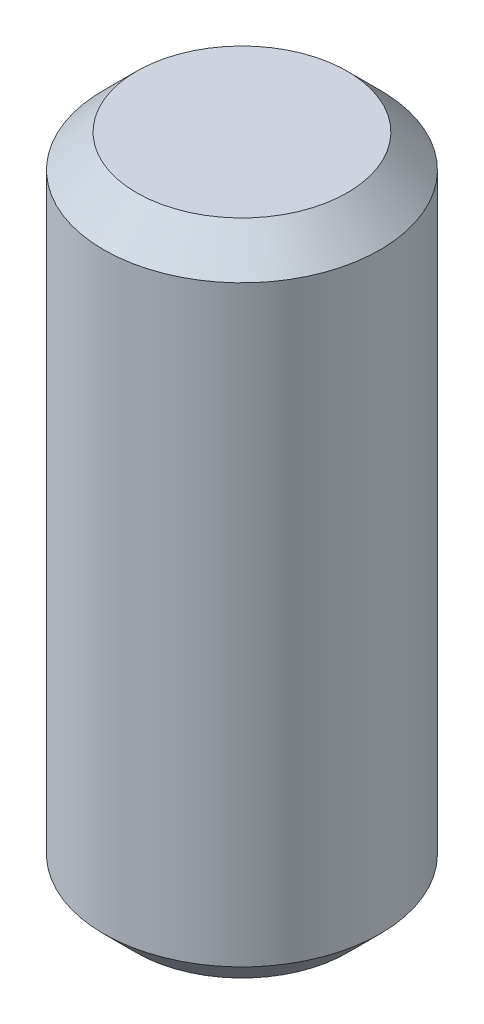
ISO-10303-21;
HEADER;
FILE_DESCRIPTION(('STEP AP214'),'2;1');
FILE_NAME('part.step','',(''),(''),'','','');
FILE_SCHEMA(('AUTOMOTIVE_DESIGN { 1 0 10303 214 1 1 1 1 }'));
ENDSEC;
DATA;
#1=APPLICATION_CONTEXT('core data for automotive mechanical design processes');
#2=APPLICATION_PROTOCOL_DEFINITION('international standard','automotive_design',2000,#1);
#3=PRODUCT_CONTEXT('',#1,'mechanical');
#4=PRODUCT('Part','Part','',(#3));
#5=PRODUCT_RELATED_PRODUCT_CATEGORY('part','',(#4));
#6=PRODUCT_DEFINITION_FORMATION('','',#4);
#7=PRODUCT_DEFINITION_CONTEXT('part definition',#1,'design');
#8=PRODUCT_DEFINITION('design','',#6,#7);
#9=PRODUCT_DEFINITION_SHAPE('','',#8);
#10=(LENGTH_UNIT() NAMED_UNIT(*) SI_UNIT(.MILLI.,.METRE.));
#11=(NAMED_UNIT(*) PLANE_ANGLE_UNIT() SI_UNIT($,.RADIAN.));
#12=(NAMED_UNIT(*) SI_UNIT($,.STERADIAN.) SOLID_ANGLE_UNIT());
#13=UNCERTAINTY_MEASURE_WITH_UNIT(LENGTH_MEASURE(1.E-05),#10,'distance_accuracy_value','');
#14=(GEOMETRIC_REPRESENTATION_CONTEXT(3) GLOBAL_UNCERTAINTY_ASSIGNED_CONTEXT((#13)) GLOBAL_UNIT_ASSIGNED_CONTEXT((#10,
#11,#12)) REPRESENTATION_CONTEXT('',''));
#15=CARTESIAN_POINT('',(0.,0.,0.));
#16=DIRECTION('',(0.,0.,1.));
#17=DIRECTION('',(1.,0.,0.));
#18=AXIS2_PLACEMENT_3D('',#15,#16,#17);
#19=CARTESIAN_POINT('',(0.,200.,0.));
#20=DIRECTION('',(0.,-1.,0.));
#21=DIRECTION('',(0.,0.,-1.));
#22=AXIS2_PLACEMENT_3D('',#19,#20,#21);
#23=CYLINDRICAL_SURFACE('',#22,42.);
#24=CARTESIAN_POINT('',(0.,9.99999999999995,0.));
#25=DIRECTION('',(0.,1.,0.));
#26=DIRECTION('',(0.,0.,1.));
#27=AXIS2_PLACEMENT_3D('',#24,#25,#26);
#28=CIRCLE('',#27,42.);
#29=CARTESIAN_POINT('',(0.,9.99999999999995,42.));
#30=VERTEX_POINT('',#29);
#31=EDGE_CURVE('E49',#30,#30,#28,.T.);
#32=ORIENTED_EDGE('',*,*,#31,.T.);
#33=EDGE_LOOP('',(#32));
#34=FACE_BOUND('',#33,.T.);
#35=CARTESIAN_POINT('',(0.,190.,0.));
#36=DIRECTION('',(0.,1.,0.));
#37=DIRECTION('',(0.,0.,1.));
#38=AXIS2_PLACEMENT_3D('',#35,#36,#37);
#39=CIRCLE('',#38,42.);
#40=CARTESIAN_POINT('',(0.,190.,42.));
#41=VERTEX_POINT('',#40);
#42=EDGE_CURVE('E54',#41,#41,#39,.F.);
#43=ORIENTED_EDGE('',*,*,#42,.T.);
#44=EDGE_LOOP('',(#43));
#45=FACE_BOUND('',#44,.T.);
#46=ADVANCED_FACE('F33',(#34,#45),#23,.T.);
#47=CARTESIAN_POINT('',(0.,200.,0.));
#48=DIRECTION('',(0.,1.,0.));
#49=DIRECTION('',(0.,0.,1.));
#50=AXIS2_PLACEMENT_3D('',#47,#48,#49);
#51=PLANE('',#50);
#52=CARTESIAN_POINT('',(0.,200.,0.));
#53=DIRECTION('',(0.,1.,0.));
#54=DIRECTION('',(0.,0.,1.));
#55=AXIS2_PLACEMENT_3D('',#52,#53,#54);
#56=CIRCLE('',#55,32.);
#57=CARTESIAN_POINT('',(0.,200.,32.));
#58=VERTEX_POINT('',#57);
#59=EDGE_CURVE('E41',#58,#58,#56,.T.);
#60=ORIENTED_EDGE('',*,*,#59,.T.);
#61=EDGE_LOOP('',(#60));
#62=FACE_BOUND('',#61,.T.);
#63=ADVANCED_FACE('F125',(#62),#51,.T.);
#64=CARTESIAN_POINT('',(0.,0.,0.));
#65=DIRECTION('',(0.,1.,0.));
#66=DIRECTION('',(0.,0.,1.));
#67=AXIS2_PLACEMENT_3D('',#64,#65,#66);
#68=PLANE('',#67);
#69=CARTESIAN_POINT('',(0.,0.,0.));
#70=DIRECTION('',(0.,1.,0.));
#71=DIRECTION('',(0.,0.,1.));
#72=AXIS2_PLACEMENT_3D('',#69,#70,#71);
#73=CIRCLE('',#72,32.);
#74=CARTESIAN_POINT('',(0.,0.,32.));
#75=VERTEX_POINT('',#74);
#76=EDGE_CURVE('E45',#75,#75,#73,.F.);
#77=ORIENTED_EDGE('',*,*,#76,.T.);
#78=EDGE_LOOP('',(#77));
#79=FACE_BOUND('',#78,.T.);
#80=ADVANCED_FACE('F131',(#79),#68,.F.);
#81=CARTESIAN_POINT('',(0.,9.99999999999995,0.));
#82=DIRECTION('',(0.,1.,0.));
#83=DIRECTION('',(0.,0.,1.));
#84=AXIS2_PLACEMENT_3D('',#81,#82,#83);
#85=CONICAL_SURFACE('',#84,42.,0.785398163397451);
#86=ORIENTED_EDGE('',*,*,#76,.F.);
#87=EDGE_LOOP('',(#86));
#88=FACE_BOUND('',#87,.T.);
#89=ORIENTED_EDGE('',*,*,#31,.F.);
#90=EDGE_LOOP('',(#89));
#91=FACE_BOUND('',#90,.T.);
#92=ADVANCED_FACE('F148',(#88,#91),#85,.T.);
#93=CARTESIAN_POINT('',(0.,200.,0.));
#94=DIRECTION('',(0.,-1.,0.));
#95=DIRECTION('',(0.,0.,-1.));
#96=AXIS2_PLACEMENT_3D('',#93,#94,#95);
#97=CONICAL_SURFACE('',#96,32.,0.785398163397445);
#98=ORIENTED_EDGE('',*,*,#42,.F.);
#99=EDGE_LOOP('',(#98));
#100=FACE_BOUND('',#99,.T.);
#101=ORIENTED_EDGE('',*,*,#59,.F.);
#102=EDGE_LOOP('',(#101));
#103=FACE_BOUND('',#102,.T.);
#104=ADVANCED_FACE('F35',(#100,#103),#97,.T.);
#105=CLOSED_SHELL('',(#46,#63,#80,#92,#104));
#106=CARTESIAN_POINT('',(0.,199.8,0.));
#107=DIRECTION('',(0.,1.,0.));
#108=DIRECTION('',(0.,0.,1.));
#109=AXIS2_PLACEMENT_3D('',#106,#107,#108);
#110=PLANE('',#109);
#111=CARTESIAN_POINT('',(0.,199.8,0.));
#112=DIRECTION('',(0.,1.,0.));
#113=DIRECTION('',(0.,0.,1.));
#114=AXIS2_PLACEMENT_3D('',#111,#112,#113);
#115=CIRCLE('',#114,31.9171572875254);
#116=CARTESIAN_POINT('',(0.,199.8,31.9171572875254));
#117=VERTEX_POINT('',#116);
#118=EDGE_CURVE('E10',#117,#117,#115,.F.);
#119=ORIENTED_EDGE('',*,*,#118,.T.);
#120=EDGE_LOOP('',(#119));
#121=FACE_BOUND('',#120,.T.);
#122=ADVANCED_FACE('F82',(#121),#110,.F.);
#123=CARTESIAN_POINT('',(0.,0.2,0.));
#124=DIRECTION('',(0.,1.,0.));
#125=DIRECTION('',(0.,0.,1.));
#126=AXIS2_PLACEMENT_3D('',#123,#124,#125);
#127=PLANE('',#126);
#128=CARTESIAN_POINT('',(0.,0.200000000000001,0.));
#129=DIRECTION('',(0.,1.,0.));
#130=DIRECTION('',(0.,0.,1.));
#131=AXIS2_PLACEMENT_3D('',#128,#129,#130);
#132=CIRCLE('',#131,31.9171572875254);
#133=CARTESIAN_POINT('',(0.,0.200000000000001,31.9171572875254));
#134=VERTEX_POINT('',#133);
#135=EDGE_CURVE('E57',#134,#134,#132,.F.);
#136=ORIENTED_EDGE('',*,*,#135,.F.);
#137=EDGE_LOOP('',(#136));
#138=FACE_BOUND('',#137,.T.);
#139=ADVANCED_FACE('F86',(#138),#127,.T.);
#140=CARTESIAN_POINT('',(0.,10.1414213562373,0.));
#141=DIRECTION('',(0.,1.,0.));
#142=DIRECTION('',(0.,0.,1.));
#143=AXIS2_PLACEMENT_3D('',#140,#141,#142);
#144=CONICAL_SURFACE('',#143,41.8585786437627,0.785398163397451);
#145=ORIENTED_EDGE('',*,*,#135,.T.);
#146=EDGE_LOOP('',(#145));
#147=FACE_BOUND('',#146,.T.);
#148=CARTESIAN_POINT('',(0.,10.0828427124746,0.));
#149=DIRECTION('',(0.,1.,0.));
#150=DIRECTION('',(0.,0.,1.));
#151=AXIS2_PLACEMENT_3D('',#148,#149,#150);
#152=CIRCLE('',#151,41.8);
#153=CARTESIAN_POINT('',(0.,10.0828427124746,41.8));
#154=VERTEX_POINT('',#153);
#155=EDGE_CURVE('E60',#154,#154,#152,.T.);
#156=ORIENTED_EDGE('',*,*,#155,.T.);
#157=EDGE_LOOP('',(#156));
#158=FACE_BOUND('',#157,.T.);
#159=ADVANCED_FACE('F67',(#147,#158),#144,.F.);
#160=CARTESIAN_POINT('',(0.,200.,0.));
#161=DIRECTION('',(0.,-1.,0.));
#162=DIRECTION('',(0.,0.,-1.));
#163=AXIS2_PLACEMENT_3D('',#160,#161,#162);
#164=CYLINDRICAL_SURFACE('',#163,41.8);
#165=ORIENTED_EDGE('',*,*,#155,.F.);
#166=EDGE_LOOP('',(#165));
#167=FACE_BOUND('',#166,.T.);
#168=CARTESIAN_POINT('',(0.,189.917157287525,0.));
#169=DIRECTION('',(0.,-1.,0.));
#170=DIRECTION('',(0.,0.,-1.));
#171=AXIS2_PLACEMENT_3D('',#168,#169,#170);
#172=CIRCLE('',#171,41.8);
#173=CARTESIAN_POINT('',(0.,189.917157287525,-41.8));
#174=VERTEX_POINT('',#173);
#175=EDGE_CURVE('E61',#174,#174,#172,.T.);
#176=ORIENTED_EDGE('',*,*,#175,.F.);
#177=EDGE_LOOP('',(#176));
#178=FACE_BOUND('',#177,.T.);
#179=ADVANCED_FACE('F69',(#167,#178),#164,.F.);
#180=CARTESIAN_POINT('',(0.,199.858578643763,0.));
#181=DIRECTION('',(0.,-1.,0.));
#182=DIRECTION('',(0.,0.,-1.));
#183=AXIS2_PLACEMENT_3D('',#180,#181,#182);
#184=CONICAL_SURFACE('',#183,31.8585786437627,0.785398163397445);
#185=ORIENTED_EDGE('',*,*,#175,.T.);
#186=EDGE_LOOP('',(#185));
#187=FACE_BOUND('',#186,.T.);
#188=ORIENTED_EDGE('',*,*,#118,.F.);
#189=EDGE_LOOP('',(#188));
#190=FACE_BOUND('',#189,.T.);
#191=ADVANCED_FACE('F72',(#187,#190),#184,.F.);
#192=CLOSED_SHELL('',(#122,#139,#159,#179,#191));
#193=ORIENTED_CLOSED_SHELL('',*,#192,.T.);
#194=BREP_WITH_VOIDS('B2',#105,(#193));
#195=ADVANCED_BREP_SHAPE_REPRESENTATION('',(#18,#194),#14);
#196=SHAPE_DEFINITION_REPRESENTATION(#9,#195);
ENDSEC;
END-ISO-10303-21;
